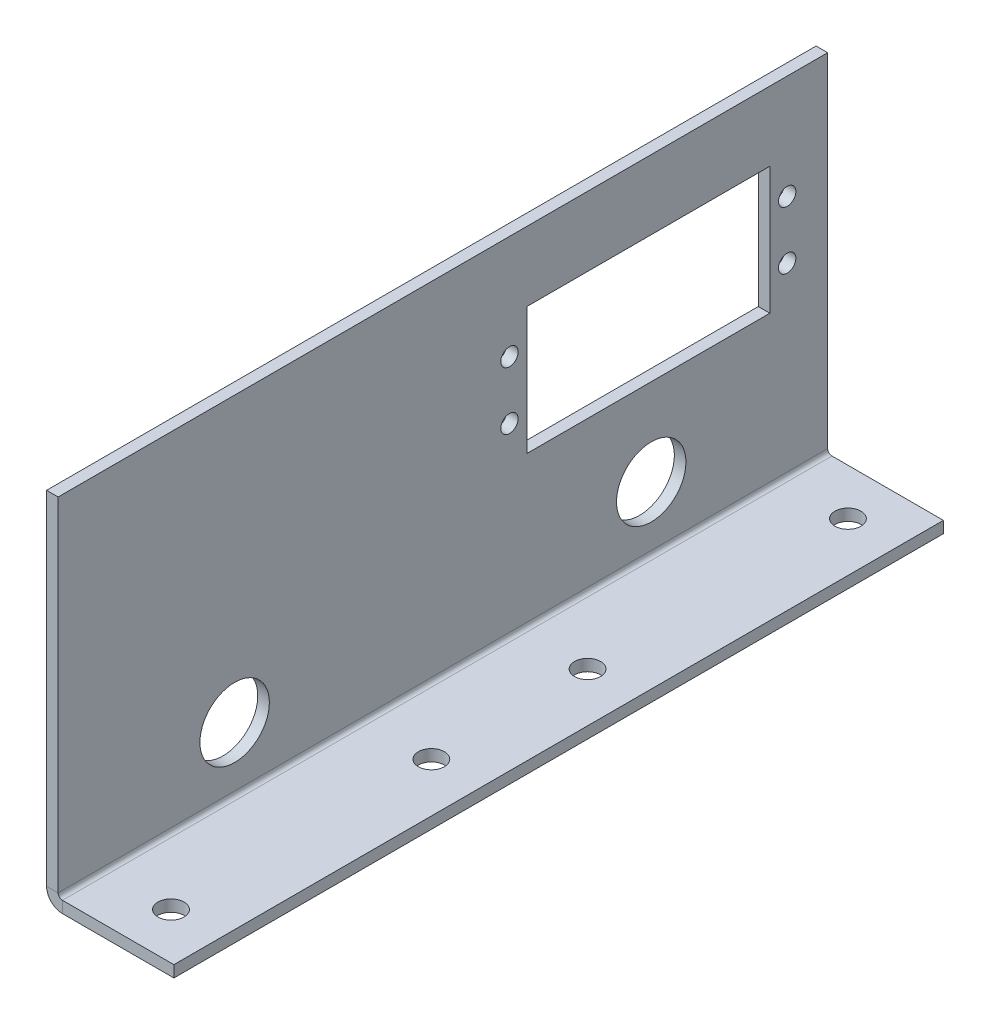
ISO-10303-21;
HEADER;
FILE_DESCRIPTION(('STEP AP214'),'2;1');
FILE_NAME('part.step','',(''),(''),'','','');
FILE_SCHEMA(('AUTOMOTIVE_DESIGN { 1 0 10303 214 1 1 1 1 }'));
ENDSEC;
DATA;
#1=APPLICATION_CONTEXT('core data for automotive mechanical design processes');
#2=APPLICATION_PROTOCOL_DEFINITION('international standard','automotive_design',2000,#1);
#3=PRODUCT_CONTEXT('',#1,'mechanical');
#4=PRODUCT('Part','Part','',(#3));
#5=PRODUCT_RELATED_PRODUCT_CATEGORY('part','',(#4));
#6=PRODUCT_DEFINITION_FORMATION('','',#4);
#7=PRODUCT_DEFINITION_CONTEXT('part definition',#1,'design');
#8=PRODUCT_DEFINITION('design','',#6,#7);
#9=PRODUCT_DEFINITION_SHAPE('','',#8);
#10=(LENGTH_UNIT() NAMED_UNIT(*) SI_UNIT(.MILLI.,.METRE.));
#11=(NAMED_UNIT(*) PLANE_ANGLE_UNIT() SI_UNIT($,.RADIAN.));
#12=(NAMED_UNIT(*) SI_UNIT($,.STERADIAN.) SOLID_ANGLE_UNIT());
#13=UNCERTAINTY_MEASURE_WITH_UNIT(LENGTH_MEASURE(1.E-05),#10,'distance_accuracy_value','');
#14=(GEOMETRIC_REPRESENTATION_CONTEXT(3) GLOBAL_UNCERTAINTY_ASSIGNED_CONTEXT((#13)) GLOBAL_UNIT_ASSIGNED_CONTEXT((#10,
#11,#12)) REPRESENTATION_CONTEXT('',''));
#15=CARTESIAN_POINT('',(0.,0.,0.));
#16=DIRECTION('',(0.,0.,1.));
#17=DIRECTION('',(1.,0.,0.));
#18=AXIS2_PLACEMENT_3D('',#15,#16,#17);
#19=CARTESIAN_POINT('',(-2.,0.,133.));
#20=DIRECTION('',(1.,0.,0.));
#21=DIRECTION('',(0.,0.,-1.));
#22=AXIS2_PLACEMENT_3D('',#19,#20,#21);
#23=PLANE('',#22);
#24=DIRECTION('',(0.,1.,0.));
#25=VECTOR('',#24,1.);
#26=CARTESIAN_POINT('',(-2.,0.,0.));
#27=LINE('',#26,#25);
#28=CARTESIAN_POINT('',(-2.,60.,0.));
#29=VERTEX_POINT('',#28);
#30=CARTESIAN_POINT('',(-2.,0.7366,0.));
#31=VERTEX_POINT('',#30);
#32=EDGE_CURVE('E216',#29,#31,#27,.F.);
#33=ORIENTED_EDGE('',*,*,#32,.T.);
#34=DIRECTION('',(0.,0.,-1.));
#35=VECTOR('',#34,1.);
#36=CARTESIAN_POINT('',(-2.,0.7366,133.));
#37=LINE('',#36,#35);
#38=CARTESIAN_POINT('',(-2.,0.7366,133.));
#39=VERTEX_POINT('',#38);
#40=EDGE_CURVE('E223',#39,#31,#37,.T.);
#41=ORIENTED_EDGE('',*,*,#40,.F.);
#42=DIRECTION('',(0.,1.,0.));
#43=VECTOR('',#42,1.);
#44=CARTESIAN_POINT('',(-2.,0.,133.));
#45=LINE('',#44,#43);
#46=CARTESIAN_POINT('',(-2.,60.,133.));
#47=VERTEX_POINT('',#46);
#48=EDGE_CURVE('E192',#47,#39,#45,.F.);
#49=ORIENTED_EDGE('',*,*,#48,.F.);
#50=DIRECTION('',(0.,0.,-1.));
#51=VECTOR('',#50,1.);
#52=CARTESIAN_POINT('',(-2.,60.,133.));
#53=LINE('',#52,#51);
#54=EDGE_CURVE('E226',#47,#29,#53,.T.);
#55=ORIENTED_EDGE('',*,*,#54,.T.);
#56=EDGE_LOOP('',(#33,#41,#49,#55));
#57=FACE_BOUND('',#56,.T.);
#58=CARTESIAN_POINT('',(-2.,11.,102.5));
#59=DIRECTION('',(-1.,0.,0.));
#60=DIRECTION('',(0.,0.,1.));
#61=AXIS2_PLACEMENT_3D('',#58,#59,#60);
#62=CIRCLE('',#61,6.);
#63=CARTESIAN_POINT('',(-2.,11.,108.5));
#64=VERTEX_POINT('',#63);
#65=EDGE_CURVE('E168',#64,#64,#62,.T.);
#66=ORIENTED_EDGE('',*,*,#65,.F.);
#67=EDGE_LOOP('',(#66));
#68=FACE_BOUND('',#67,.T.);
#69=CARTESIAN_POINT('',(-2.,11.,30.4999999999999));
#70=DIRECTION('',(-1.,0.,0.));
#71=DIRECTION('',(0.,0.,-1.));
#72=AXIS2_PLACEMENT_3D('',#69,#70,#71);
#73=CIRCLE('',#72,6.);
#74=CARTESIAN_POINT('',(-2.,11.,24.4999999999999));
#75=VERTEX_POINT('',#74);
#76=EDGE_CURVE('E162',#75,#75,#73,.T.);
#77=ORIENTED_EDGE('',*,*,#76,.F.);
#78=EDGE_LOOP('',(#77));
#79=FACE_BOUND('',#78,.T.);
#80=DIRECTION('',(0.,0.,1.));
#81=VECTOR('',#80,1.);
#82=CARTESIAN_POINT('',(-2.,26.,10.));
#83=LINE('',#82,#81);
#84=CARTESIAN_POINT('',(-2.,26.,10.));
#85=VERTEX_POINT('',#84);
#86=CARTESIAN_POINT('',(-2.,26.,52.));
#87=VERTEX_POINT('',#86);
#88=EDGE_CURVE('E146',#85,#87,#83,.T.);
#89=ORIENTED_EDGE('',*,*,#88,.F.);
#90=DIRECTION('',(0.,-1.,0.));
#91=VECTOR('',#90,1.);
#92=CARTESIAN_POINT('',(-2.,26.,10.));
#93=LINE('',#92,#91);
#94=CARTESIAN_POINT('',(-2.,48.,10.));
#95=VERTEX_POINT('',#94);
#96=EDGE_CURVE('E62',#95,#85,#93,.T.);
#97=ORIENTED_EDGE('',*,*,#96,.F.);
#98=DIRECTION('',(0.,0.,-1.));
#99=VECTOR('',#98,1.);
#100=CARTESIAN_POINT('',(-2.,48.,10.));
#101=LINE('',#100,#99);
#102=CARTESIAN_POINT('',(-2.,48.,52.));
#103=VERTEX_POINT('',#102);
#104=EDGE_CURVE('E139',#103,#95,#101,.T.);
#105=ORIENTED_EDGE('',*,*,#104,.F.);
#106=DIRECTION('',(0.,1.,0.));
#107=VECTOR('',#106,1.);
#108=CARTESIAN_POINT('',(-2.,26.,52.));
#109=LINE('',#108,#107);
#110=EDGE_CURVE('E153',#87,#103,#109,.T.);
#111=ORIENTED_EDGE('',*,*,#110,.F.);
#112=EDGE_LOOP('',(#89,#97,#105,#111));
#113=FACE_BOUND('',#112,.T.);
#114=CARTESIAN_POINT('',(-2.,32.,7.));
#115=DIRECTION('',(-1.,0.,0.));
#116=DIRECTION('',(0.,0.,1.));
#117=AXIS2_PLACEMENT_3D('',#114,#115,#116);
#118=CIRCLE('',#117,1.5);
#119=CARTESIAN_POINT('',(-2.,32.,8.5));
#120=VERTEX_POINT('',#119);
#121=EDGE_CURVE('E264',#120,#120,#118,.T.);
#122=ORIENTED_EDGE('',*,*,#121,.F.);
#123=EDGE_LOOP('',(#122));
#124=FACE_BOUND('',#123,.T.);
#125=CARTESIAN_POINT('',(-2.,42.,7.));
#126=DIRECTION('',(-1.,0.,0.));
#127=DIRECTION('',(0.,0.,1.));
#128=AXIS2_PLACEMENT_3D('',#125,#126,#127);
#129=CIRCLE('',#128,1.5);
#130=CARTESIAN_POINT('',(-2.,42.,8.5));
#131=VERTEX_POINT('',#130);
#132=EDGE_CURVE('E246',#131,#131,#129,.T.);
#133=ORIENTED_EDGE('',*,*,#132,.F.);
#134=EDGE_LOOP('',(#133));
#135=FACE_BOUND('',#134,.T.);
#136=CARTESIAN_POINT('',(-2.,32.,55.));
#137=DIRECTION('',(-1.,0.,0.));
#138=DIRECTION('',(0.,0.,1.));
#139=AXIS2_PLACEMENT_3D('',#136,#137,#138);
#140=CIRCLE('',#139,1.5);
#141=CARTESIAN_POINT('',(-2.,32.,56.5));
#142=VERTEX_POINT('',#141);
#143=EDGE_CURVE('E247',#142,#142,#140,.T.);
#144=ORIENTED_EDGE('',*,*,#143,.F.);
#145=EDGE_LOOP('',(#144));
#146=FACE_BOUND('',#145,.T.);
#147=CARTESIAN_POINT('',(-2.,42.,55.));
#148=DIRECTION('',(-1.,0.,0.));
#149=DIRECTION('',(0.,0.,1.));
#150=AXIS2_PLACEMENT_3D('',#147,#148,#149);
#151=CIRCLE('',#150,1.5);
#152=CARTESIAN_POINT('',(-2.,42.,56.5));
#153=VERTEX_POINT('',#152);
#154=EDGE_CURVE('E258',#153,#153,#151,.T.);
#155=ORIENTED_EDGE('',*,*,#154,.F.);
#156=EDGE_LOOP('',(#155));
#157=FACE_BOUND('',#156,.T.);
#158=ADVANCED_FACE('F37',(#57,#68,#79,#113,#124,#135,#146,#157),#23,.F.);
#159=CARTESIAN_POINT('',(0.7366,0.,133.));
#160=DIRECTION('',(0.,0.,1.));
#161=DIRECTION('',(1.,0.,0.));
#162=AXIS2_PLACEMENT_3D('',#159,#160,#161);
#163=PLANE('',#162);
#164=DIRECTION('',(0.,-1.,0.));
#165=VECTOR('',#164,1.);
#166=CARTESIAN_POINT('',(0.7366,0.,133.));
#167=LINE('',#166,#165);
#168=CARTESIAN_POINT('',(0.7366,0.,133.));
#169=VERTEX_POINT('',#168);
#170=CARTESIAN_POINT('',(0.7366,-2.,133.));
#171=VERTEX_POINT('',#170);
#172=EDGE_CURVE('E11',#169,#171,#167,.T.);
#173=ORIENTED_EDGE('',*,*,#172,.F.);
#174=CARTESIAN_POINT('',(0.7366,0.7366,133.));
#175=DIRECTION('',(0.,0.,-1.));
#176=DIRECTION('',(-1.,0.,0.));
#177=AXIS2_PLACEMENT_3D('',#174,#175,#176);
#178=CIRCLE('',#177,0.7366);
#179=CARTESIAN_POINT('',(0.,0.7366,133.));
#180=VERTEX_POINT('',#179);
#181=EDGE_CURVE('E183',#180,#169,#178,.F.);
#182=ORIENTED_EDGE('',*,*,#181,.F.);
#183=DIRECTION('',(1.,0.,0.));
#184=VECTOR('',#183,1.);
#185=CARTESIAN_POINT('',(-2.,0.7366,133.));
#186=LINE('',#185,#184);
#187=EDGE_CURVE('E46',#39,#180,#186,.T.);
#188=ORIENTED_EDGE('',*,*,#187,.F.);
#189=CARTESIAN_POINT('',(0.7366,0.7366,133.));
#190=DIRECTION('',(0.,0.,1.));
#191=DIRECTION('',(1.,0.,0.));
#192=AXIS2_PLACEMENT_3D('',#189,#190,#191);
#193=CIRCLE('',#192,2.7366);
#194=EDGE_CURVE('E195',#39,#171,#193,.T.);
#195=ORIENTED_EDGE('',*,*,#194,.T.);
#196=EDGE_LOOP('',(#173,#182,#188,#195));
#197=FACE_BOUND('',#196,.T.);
#198=ADVANCED_FACE('F39',(#197),#163,.T.);
#199=CARTESIAN_POINT('',(-2.,0.7366,133.));
#200=DIRECTION('',(0.,0.,1.));
#201=DIRECTION('',(1.,0.,0.));
#202=AXIS2_PLACEMENT_3D('',#199,#200,#201);
#203=PLANE('',#202);
#204=DIRECTION('',(1.,0.,0.));
#205=VECTOR('',#204,1.);
#206=CARTESIAN_POINT('',(0.,0.,133.));
#207=LINE('',#206,#205);
#208=CARTESIAN_POINT('',(20.,0.,133.));
#209=VERTEX_POINT('',#208);
#210=EDGE_CURVE('E180',#169,#209,#207,.T.);
#211=ORIENTED_EDGE('',*,*,#210,.F.);
#212=ORIENTED_EDGE('',*,*,#172,.T.);
#213=DIRECTION('',(1.,0.,0.));
#214=VECTOR('',#213,1.);
#215=CARTESIAN_POINT('',(0.,-2.,133.));
#216=LINE('',#215,#214);
#217=CARTESIAN_POINT('',(20.,-2.,133.));
#218=VERTEX_POINT('',#217);
#219=EDGE_CURVE('E174',#171,#218,#216,.T.);
#220=ORIENTED_EDGE('',*,*,#219,.T.);
#221=DIRECTION('',(0.,-1.,0.));
#222=VECTOR('',#221,1.);
#223=CARTESIAN_POINT('',(20.,0.,133.));
#224=LINE('',#223,#222);
#225=EDGE_CURVE('E176',#209,#218,#224,.T.);
#226=ORIENTED_EDGE('',*,*,#225,.F.);
#227=EDGE_LOOP('',(#211,#212,#220,#226));
#228=FACE_BOUND('',#227,.T.);
#229=ADVANCED_FACE('F372',(#228),#203,.T.);
#230=CARTESIAN_POINT('',(0.,0.7366,0.));
#231=DIRECTION('',(0.,0.,-1.));
#232=DIRECTION('',(-1.,0.,0.));
#233=AXIS2_PLACEMENT_3D('',#230,#231,#232);
#234=PLANE('',#233);
#235=DIRECTION('',(-1.,0.,0.));
#236=VECTOR('',#235,1.);
#237=CARTESIAN_POINT('',(0.,0.7366,0.));
#238=LINE('',#237,#236);
#239=CARTESIAN_POINT('',(0.,0.7366,0.));
#240=VERTEX_POINT('',#239);
#241=EDGE_CURVE('E242',#240,#31,#238,.T.);
#242=ORIENTED_EDGE('',*,*,#241,.F.);
#243=CARTESIAN_POINT('',(0.7366,0.7366,0.));
#244=DIRECTION('',(0.,0.,-1.));
#245=DIRECTION('',(-1.,0.,0.));
#246=AXIS2_PLACEMENT_3D('',#243,#244,#245);
#247=CIRCLE('',#246,0.7366);
#248=CARTESIAN_POINT('',(0.7366,0.,0.));
#249=VERTEX_POINT('',#248);
#250=EDGE_CURVE('E207',#240,#249,#247,.F.);
#251=ORIENTED_EDGE('',*,*,#250,.T.);
#252=DIRECTION('',(0.,1.,0.));
#253=VECTOR('',#252,1.);
#254=CARTESIAN_POINT('',(0.7366,-2.,0.));
#255=LINE('',#254,#253);
#256=CARTESIAN_POINT('',(0.7366,-2.,0.));
#257=VERTEX_POINT('',#256);
#258=EDGE_CURVE('E240',#257,#249,#255,.T.);
#259=ORIENTED_EDGE('',*,*,#258,.F.);
#260=CARTESIAN_POINT('',(0.7366,0.7366,0.));
#261=DIRECTION('',(0.,0.,1.));
#262=DIRECTION('',(1.,0.,0.));
#263=AXIS2_PLACEMENT_3D('',#260,#261,#262);
#264=CIRCLE('',#263,2.7366);
#265=EDGE_CURVE('E177',#31,#257,#264,.T.);
#266=ORIENTED_EDGE('',*,*,#265,.F.);
#267=EDGE_LOOP('',(#242,#251,#259,#266));
#268=FACE_BOUND('',#267,.T.);
#269=ADVANCED_FACE('F345',(#268),#234,.T.);
#270=CARTESIAN_POINT('',(0.7366,-2.,0.));
#271=DIRECTION('',(0.,0.,-1.));
#272=DIRECTION('',(-1.,0.,0.));
#273=AXIS2_PLACEMENT_3D('',#270,#271,#272);
#274=PLANE('',#273);
#275=DIRECTION('',(0.,-1.,0.));
#276=VECTOR('',#275,1.);
#277=CARTESIAN_POINT('',(0.,0.,0.));
#278=LINE('',#277,#276);
#279=CARTESIAN_POINT('',(0.,60.,0.));
#280=VERTEX_POINT('',#279);
#281=EDGE_CURVE('E210',#280,#240,#278,.T.);
#282=ORIENTED_EDGE('',*,*,#281,.T.);
#283=ORIENTED_EDGE('',*,*,#241,.T.);
#284=ORIENTED_EDGE('',*,*,#32,.F.);
#285=DIRECTION('',(1.,0.,0.));
#286=VECTOR('',#285,1.);
#287=CARTESIAN_POINT('',(-2.,60.,0.));
#288=LINE('',#287,#286);
#289=EDGE_CURVE('E213',#29,#280,#288,.T.);
#290=ORIENTED_EDGE('',*,*,#289,.T.);
#291=EDGE_LOOP('',(#282,#283,#284,#290));
#292=FACE_BOUND('',#291,.T.);
#293=ADVANCED_FACE('F352',(#292),#274,.T.);
#294=CARTESIAN_POINT('',(0.,-2.,133.));
#295=DIRECTION('',(0.,1.,0.));
#296=DIRECTION('',(0.,0.,1.));
#297=AXIS2_PLACEMENT_3D('',#294,#295,#296);
#298=PLANE('',#297);
#299=CARTESIAN_POINT('',(11.5,-2.,125.));
#300=DIRECTION('',(0.,1.,0.));
#301=DIRECTION('',(0.,0.,1.));
#302=AXIS2_PLACEMENT_3D('',#299,#300,#301);
#303=CIRCLE('',#302,2.25);
#304=CARTESIAN_POINT('',(11.5,-2.,127.25));
#305=VERTEX_POINT('',#304);
#306=EDGE_CURVE('E307',#305,#305,#303,.T.);
#307=ORIENTED_EDGE('',*,*,#306,.T.);
#308=EDGE_LOOP('',(#307));
#309=FACE_BOUND('',#308,.T.);
#310=CARTESIAN_POINT('',(11.5,-2.,53.));
#311=DIRECTION('',(0.,1.,0.));
#312=DIRECTION('',(0.,0.,1.));
#313=AXIS2_PLACEMENT_3D('',#310,#311,#312);
#314=CIRCLE('',#313,2.25);
#315=CARTESIAN_POINT('',(11.5,-2.,55.25));
#316=VERTEX_POINT('',#315);
#317=EDGE_CURVE('E301',#316,#316,#314,.T.);
#318=ORIENTED_EDGE('',*,*,#317,.T.);
#319=EDGE_LOOP('',(#318));
#320=FACE_BOUND('',#319,.T.);
#321=CARTESIAN_POINT('',(11.5,-2.,8.));
#322=DIRECTION('',(0.,1.,0.));
#323=DIRECTION('',(0.,0.,1.));
#324=AXIS2_PLACEMENT_3D('',#321,#322,#323);
#325=CIRCLE('',#324,2.25);
#326=CARTESIAN_POINT('',(11.5,-2.,10.25));
#327=VERTEX_POINT('',#326);
#328=EDGE_CURVE('E296',#327,#327,#325,.T.);
#329=ORIENTED_EDGE('',*,*,#328,.T.);
#330=EDGE_LOOP('',(#329));
#331=FACE_BOUND('',#330,.T.);
#332=CARTESIAN_POINT('',(11.5,-2.,80.));
#333=DIRECTION('',(0.,1.,0.));
#334=DIRECTION('',(0.,0.,1.));
#335=AXIS2_PLACEMENT_3D('',#332,#333,#334);
#336=CIRCLE('',#335,2.25);
#337=CARTESIAN_POINT('',(11.5,-2.,82.25));
#338=VERTEX_POINT('',#337);
#339=EDGE_CURVE('E289',#338,#338,#336,.T.);
#340=ORIENTED_EDGE('',*,*,#339,.T.);
#341=EDGE_LOOP('',(#340));
#342=FACE_BOUND('',#341,.T.);
#343=DIRECTION('',(1.,0.,0.));
#344=VECTOR('',#343,1.);
#345=CARTESIAN_POINT('',(0.,-2.,0.));
#346=LINE('',#345,#344);
#347=CARTESIAN_POINT('',(20.,-2.,0.));
#348=VERTEX_POINT('',#347);
#349=EDGE_CURVE('E171',#257,#348,#346,.T.);
#350=ORIENTED_EDGE('',*,*,#349,.T.);
#351=DIRECTION('',(0.,0.,-1.));
#352=VECTOR('',#351,1.);
#353=CARTESIAN_POINT('',(20.,-2.,133.));
#354=LINE('',#353,#352);
#355=EDGE_CURVE('E238',#218,#348,#354,.T.);
#356=ORIENTED_EDGE('',*,*,#355,.F.);
#357=ORIENTED_EDGE('',*,*,#219,.F.);
#358=DIRECTION('',(0.,0.,-1.));
#359=VECTOR('',#358,1.);
#360=CARTESIAN_POINT('',(0.7366,-2.,133.));
#361=LINE('',#360,#359);
#362=EDGE_CURVE('E198',#171,#257,#361,.T.);
#363=ORIENTED_EDGE('',*,*,#362,.T.);
#364=EDGE_LOOP('',(#350,#356,#357,#363));
#365=FACE_BOUND('',#364,.T.);
#366=ADVANCED_FACE('F316',(#309,#320,#331,#342,#365),#298,.F.);
#367=CARTESIAN_POINT('',(20.,0.,133.));
#368=DIRECTION('',(1.,0.,0.));
#369=DIRECTION('',(0.,0.,-1.));
#370=AXIS2_PLACEMENT_3D('',#367,#368,#369);
#371=PLANE('',#370);
#372=DIRECTION('',(0.,-1.,0.));
#373=VECTOR('',#372,1.);
#374=CARTESIAN_POINT('',(20.,0.,0.));
#375=LINE('',#374,#373);
#376=CARTESIAN_POINT('',(20.,0.,0.));
#377=VERTEX_POINT('',#376);
#378=EDGE_CURVE('E201',#377,#348,#375,.T.);
#379=ORIENTED_EDGE('',*,*,#378,.F.);
#380=DIRECTION('',(0.,0.,-1.));
#381=VECTOR('',#380,1.);
#382=CARTESIAN_POINT('',(20.,0.,133.));
#383=LINE('',#382,#381);
#384=EDGE_CURVE('E236',#209,#377,#383,.T.);
#385=ORIENTED_EDGE('',*,*,#384,.F.);
#386=ORIENTED_EDGE('',*,*,#225,.T.);
#387=ORIENTED_EDGE('',*,*,#355,.T.);
#388=EDGE_LOOP('',(#379,#385,#386,#387));
#389=FACE_BOUND('',#388,.T.);
#390=ADVANCED_FACE('F330',(#389),#371,.T.);
#391=CARTESIAN_POINT('',(0.,0.,133.));
#392=DIRECTION('',(0.,1.,0.));
#393=DIRECTION('',(0.,0.,1.));
#394=AXIS2_PLACEMENT_3D('',#391,#392,#393);
#395=PLANE('',#394);
#396=CARTESIAN_POINT('',(11.5,0.,125.));
#397=DIRECTION('',(0.,1.,0.));
#398=DIRECTION('',(0.,0.,1.));
#399=AXIS2_PLACEMENT_3D('',#396,#397,#398);
#400=CIRCLE('',#399,2.25);
#401=CARTESIAN_POINT('',(11.5,0.,127.25));
#402=VERTEX_POINT('',#401);
#403=EDGE_CURVE('E310',#402,#402,#400,.T.);
#404=ORIENTED_EDGE('',*,*,#403,.F.);
#405=EDGE_LOOP('',(#404));
#406=FACE_BOUND('',#405,.T.);
#407=CARTESIAN_POINT('',(11.5,0.,53.));
#408=DIRECTION('',(0.,1.,0.));
#409=DIRECTION('',(0.,0.,1.));
#410=AXIS2_PLACEMENT_3D('',#407,#408,#409);
#411=CIRCLE('',#410,2.25);
#412=CARTESIAN_POINT('',(11.5,0.,55.25));
#413=VERTEX_POINT('',#412);
#414=EDGE_CURVE('E304',#413,#413,#411,.T.);
#415=ORIENTED_EDGE('',*,*,#414,.F.);
#416=EDGE_LOOP('',(#415));
#417=FACE_BOUND('',#416,.T.);
#418=CARTESIAN_POINT('',(11.5,0.,8.));
#419=DIRECTION('',(0.,1.,0.));
#420=DIRECTION('',(0.,0.,1.));
#421=AXIS2_PLACEMENT_3D('',#418,#419,#420);
#422=CIRCLE('',#421,2.25);
#423=CARTESIAN_POINT('',(11.5,0.,10.25));
#424=VERTEX_POINT('',#423);
#425=EDGE_CURVE('E298',#424,#424,#422,.T.);
#426=ORIENTED_EDGE('',*,*,#425,.F.);
#427=EDGE_LOOP('',(#426));
#428=FACE_BOUND('',#427,.T.);
#429=CARTESIAN_POINT('',(11.5,0.,80.));
#430=DIRECTION('',(0.,1.,0.));
#431=DIRECTION('',(0.,0.,1.));
#432=AXIS2_PLACEMENT_3D('',#429,#430,#431);
#433=CIRCLE('',#432,2.25);
#434=CARTESIAN_POINT('',(11.5,0.,82.25));
#435=VERTEX_POINT('',#434);
#436=EDGE_CURVE('E291',#435,#435,#433,.T.);
#437=ORIENTED_EDGE('',*,*,#436,.F.);
#438=EDGE_LOOP('',(#437));
#439=FACE_BOUND('',#438,.T.);
#440=DIRECTION('',(1.,0.,0.));
#441=VECTOR('',#440,1.);
#442=CARTESIAN_POINT('',(0.,0.,0.));
#443=LINE('',#442,#441);
#444=EDGE_CURVE('E204',#249,#377,#443,.T.);
#445=ORIENTED_EDGE('',*,*,#444,.F.);
#446=DIRECTION('',(0.,0.,-1.));
#447=VECTOR('',#446,1.);
#448=CARTESIAN_POINT('',(0.7366,0.,133.));
#449=LINE('',#448,#447);
#450=EDGE_CURVE('E233',#169,#249,#449,.T.);
#451=ORIENTED_EDGE('',*,*,#450,.F.);
#452=ORIENTED_EDGE('',*,*,#210,.T.);
#453=ORIENTED_EDGE('',*,*,#384,.T.);
#454=EDGE_LOOP('',(#445,#451,#452,#453));
#455=FACE_BOUND('',#454,.T.);
#456=ADVANCED_FACE('F326',(#406,#417,#428,#439,#455),#395,.T.);
#457=CARTESIAN_POINT('',(0.7366,0.7366,133.));
#458=DIRECTION('',(0.,0.,-1.));
#459=DIRECTION('',(-1.,0.,0.));
#460=AXIS2_PLACEMENT_3D('',#457,#458,#459);
#461=CYLINDRICAL_SURFACE('',#460,0.7366);
#462=ORIENTED_EDGE('',*,*,#250,.F.);
#463=DIRECTION('',(0.,0.,-1.));
#464=VECTOR('',#463,1.);
#465=CARTESIAN_POINT('',(0.,0.7366,133.));
#466=LINE('',#465,#464);
#467=EDGE_CURVE('E230',#180,#240,#466,.T.);
#468=ORIENTED_EDGE('',*,*,#467,.F.);
#469=ORIENTED_EDGE('',*,*,#181,.T.);
#470=ORIENTED_EDGE('',*,*,#450,.T.);
#471=EDGE_LOOP('',(#462,#468,#469,#470));
#472=FACE_BOUND('',#471,.T.);
#473=ADVANCED_FACE('F329',(#472),#461,.F.);
#474=CARTESIAN_POINT('',(0.,0.,133.));
#475=DIRECTION('',(1.,0.,0.));
#476=DIRECTION('',(0.,0.,-1.));
#477=AXIS2_PLACEMENT_3D('',#474,#475,#476);
#478=PLANE('',#477);
#479=CARTESIAN_POINT('',(0.,42.,55.));
#480=DIRECTION('',(1.,0.,0.));
#481=DIRECTION('',(0.,0.,-1.));
#482=AXIS2_PLACEMENT_3D('',#479,#480,#481);
#483=CIRCLE('',#482,1.5);
#484=CARTESIAN_POINT('',(0.,42.,53.5));
#485=VERTEX_POINT('',#484);
#486=EDGE_CURVE('E41',#485,#485,#483,.T.);
#487=ORIENTED_EDGE('',*,*,#486,.F.);
#488=EDGE_LOOP('',(#487));
#489=FACE_BOUND('',#488,.T.);
#490=CARTESIAN_POINT('',(0.,32.,55.));
#491=DIRECTION('',(1.,0.,0.));
#492=DIRECTION('',(0.,0.,-1.));
#493=AXIS2_PLACEMENT_3D('',#490,#491,#492);
#494=CIRCLE('',#493,1.5);
#495=CARTESIAN_POINT('',(0.,32.,53.5));
#496=VERTEX_POINT('',#495);
#497=EDGE_CURVE('E244',#496,#496,#494,.T.);
#498=ORIENTED_EDGE('',*,*,#497,.F.);
#499=EDGE_LOOP('',(#498));
#500=FACE_BOUND('',#499,.T.);
#501=CARTESIAN_POINT('',(0.,42.,7.));
#502=DIRECTION('',(1.,0.,0.));
#503=DIRECTION('',(0.,0.,-1.));
#504=AXIS2_PLACEMENT_3D('',#501,#502,#503);
#505=CIRCLE('',#504,1.5);
#506=CARTESIAN_POINT('',(0.,42.,5.49999999999999));
#507=VERTEX_POINT('',#506);
#508=EDGE_CURVE('E251',#507,#507,#505,.T.);
#509=ORIENTED_EDGE('',*,*,#508,.F.);
#510=EDGE_LOOP('',(#509));
#511=FACE_BOUND('',#510,.T.);
#512=CARTESIAN_POINT('',(0.,32.,7.));
#513=DIRECTION('',(1.,0.,0.));
#514=DIRECTION('',(0.,0.,-1.));
#515=AXIS2_PLACEMENT_3D('',#512,#513,#514);
#516=CIRCLE('',#515,1.5);
#517=CARTESIAN_POINT('',(0.,32.,5.49999999999999));
#518=VERTEX_POINT('',#517);
#519=EDGE_CURVE('E267',#518,#518,#516,.T.);
#520=ORIENTED_EDGE('',*,*,#519,.F.);
#521=EDGE_LOOP('',(#520));
#522=FACE_BOUND('',#521,.T.);
#523=DIRECTION('',(0.,-1.,0.));
#524=VECTOR('',#523,1.);
#525=CARTESIAN_POINT('',(0.,26.,10.));
#526=LINE('',#525,#524);
#527=CARTESIAN_POINT('',(0.,48.,10.));
#528=VERTEX_POINT('',#527);
#529=CARTESIAN_POINT('',(0.,26.,10.));
#530=VERTEX_POINT('',#529);
#531=EDGE_CURVE('E137',#528,#530,#526,.T.);
#532=ORIENTED_EDGE('',*,*,#531,.T.);
#533=DIRECTION('',(0.,0.,1.));
#534=VECTOR('',#533,1.);
#535=CARTESIAN_POINT('',(0.,26.,10.));
#536=LINE('',#535,#534);
#537=CARTESIAN_POINT('',(0.,26.,52.));
#538=VERTEX_POINT('',#537);
#539=EDGE_CURVE('E126',#530,#538,#536,.T.);
#540=ORIENTED_EDGE('',*,*,#539,.T.);
#541=DIRECTION('',(0.,1.,0.));
#542=VECTOR('',#541,1.);
#543=CARTESIAN_POINT('',(0.,26.,52.));
#544=LINE('',#543,#542);
#545=CARTESIAN_POINT('',(0.,48.,52.));
#546=VERTEX_POINT('',#545);
#547=EDGE_CURVE('E148',#538,#546,#544,.T.);
#548=ORIENTED_EDGE('',*,*,#547,.T.);
#549=DIRECTION('',(0.,0.,-1.));
#550=VECTOR('',#549,1.);
#551=CARTESIAN_POINT('',(0.,48.,10.));
#552=LINE('',#551,#550);
#553=EDGE_CURVE('E144',#546,#528,#552,.T.);
#554=ORIENTED_EDGE('',*,*,#553,.T.);
#555=EDGE_LOOP('',(#532,#540,#548,#554));
#556=FACE_BOUND('',#555,.T.);
#557=CARTESIAN_POINT('',(0.,11.,30.4999999999999));
#558=DIRECTION('',(1.,0.,0.));
#559=DIRECTION('',(0.,0.,-1.));
#560=AXIS2_PLACEMENT_3D('',#557,#558,#559);
#561=CIRCLE('',#560,6.);
#562=CARTESIAN_POINT('',(0.,11.,24.4999999999999));
#563=VERTEX_POINT('',#562);
#564=EDGE_CURVE('E133',#563,#563,#561,.F.);
#565=ORIENTED_EDGE('',*,*,#564,.T.);
#566=EDGE_LOOP('',(#565));
#567=FACE_BOUND('',#566,.T.);
#568=CARTESIAN_POINT('',(0.,11.,102.5));
#569=DIRECTION('',(1.,0.,0.));
#570=DIRECTION('',(0.,0.,-1.));
#571=AXIS2_PLACEMENT_3D('',#568,#569,#570);
#572=CIRCLE('',#571,6.);
#573=CARTESIAN_POINT('',(0.,11.,96.5000000000001));
#574=VERTEX_POINT('',#573);
#575=EDGE_CURVE('E165',#574,#574,#572,.F.);
#576=ORIENTED_EDGE('',*,*,#575,.T.);
#577=EDGE_LOOP('',(#576));
#578=FACE_BOUND('',#577,.T.);
#579=ORIENTED_EDGE('',*,*,#281,.F.);
#580=DIRECTION('',(0.,0.,-1.));
#581=VECTOR('',#580,1.);
#582=CARTESIAN_POINT('',(0.,60.,133.));
#583=LINE('',#582,#581);
#584=CARTESIAN_POINT('',(0.,60.,133.));
#585=VERTEX_POINT('',#584);
#586=EDGE_CURVE('E228',#585,#280,#583,.T.);
#587=ORIENTED_EDGE('',*,*,#586,.F.);
#588=DIRECTION('',(0.,-1.,0.));
#589=VECTOR('',#588,1.);
#590=CARTESIAN_POINT('',(0.,0.,133.));
#591=LINE('',#590,#589);
#592=EDGE_CURVE('E186',#585,#180,#591,.T.);
#593=ORIENTED_EDGE('',*,*,#592,.T.);
#594=ORIENTED_EDGE('',*,*,#467,.T.);
#595=EDGE_LOOP('',(#579,#587,#593,#594));
#596=FACE_BOUND('',#595,.T.);
#597=ADVANCED_FACE('F142',(#489,#500,#511,#522,#556,#567,#578,#596),#478,.T.);
#598=CARTESIAN_POINT('',(-2.,60.,133.));
#599=DIRECTION('',(0.,1.,0.));
#600=DIRECTION('',(0.,0.,1.));
#601=AXIS2_PLACEMENT_3D('',#598,#599,#600);
#602=PLANE('',#601);
#603=ORIENTED_EDGE('',*,*,#289,.F.);
#604=ORIENTED_EDGE('',*,*,#54,.F.);
#605=DIRECTION('',(1.,0.,0.));
#606=VECTOR('',#605,1.);
#607=CARTESIAN_POINT('',(-2.,60.,133.));
#608=LINE('',#607,#606);
#609=EDGE_CURVE('E189',#47,#585,#608,.T.);
#610=ORIENTED_EDGE('',*,*,#609,.T.);
#611=ORIENTED_EDGE('',*,*,#586,.T.);
#612=EDGE_LOOP('',(#603,#604,#610,#611));
#613=FACE_BOUND('',#612,.T.);
#614=ADVANCED_FACE('F361',(#613),#602,.T.);
#615=CARTESIAN_POINT('',(0.7366,0.7366,133.));
#616=DIRECTION('',(0.,0.,-1.));
#617=DIRECTION('',(-1.,0.,0.));
#618=AXIS2_PLACEMENT_3D('',#615,#616,#617);
#619=CYLINDRICAL_SURFACE('',#618,2.7366);
#620=ORIENTED_EDGE('',*,*,#265,.T.);
#621=ORIENTED_EDGE('',*,*,#362,.F.);
#622=ORIENTED_EDGE('',*,*,#194,.F.);
#623=ORIENTED_EDGE('',*,*,#40,.T.);
#624=EDGE_LOOP('',(#620,#621,#622,#623));
#625=FACE_BOUND('',#624,.T.);
#626=ADVANCED_FACE('F368',(#625),#619,.T.);
#627=CARTESIAN_POINT('',(0.7366,0.7366,133.));
#628=DIRECTION('',(0.,0.,-1.));
#629=DIRECTION('',(-1.,0.,0.));
#630=AXIS2_PLACEMENT_3D('',#627,#628,#629);
#631=PLANE('',#630);
#632=ORIENTED_EDGE('',*,*,#48,.T.);
#633=ORIENTED_EDGE('',*,*,#187,.T.);
#634=ORIENTED_EDGE('',*,*,#592,.F.);
#635=ORIENTED_EDGE('',*,*,#609,.F.);
#636=EDGE_LOOP('',(#632,#633,#634,#635));
#637=FACE_BOUND('',#636,.T.);
#638=ADVANCED_FACE('F359',(#637),#631,.F.);
#639=CARTESIAN_POINT('',(0.7366,0.7366,0.));
#640=DIRECTION('',(0.,0.,-1.));
#641=DIRECTION('',(-1.,0.,0.));
#642=AXIS2_PLACEMENT_3D('',#639,#640,#641);
#643=PLANE('',#642);
#644=ORIENTED_EDGE('',*,*,#349,.F.);
#645=ORIENTED_EDGE('',*,*,#258,.T.);
#646=ORIENTED_EDGE('',*,*,#444,.T.);
#647=ORIENTED_EDGE('',*,*,#378,.T.);
#648=EDGE_LOOP('',(#644,#645,#646,#647));
#649=FACE_BOUND('',#648,.T.);
#650=ADVANCED_FACE('F377',(#649),#643,.T.);
#651=CARTESIAN_POINT('',(20.001,11.,102.5));
#652=DIRECTION('',(-1.,0.,0.));
#653=DIRECTION('',(0.,0.,1.));
#654=AXIS2_PLACEMENT_3D('',#651,#652,#653);
#655=CYLINDRICAL_SURFACE('',#654,6.);
#656=ORIENTED_EDGE('',*,*,#575,.F.);
#657=EDGE_LOOP('',(#656));
#658=FACE_BOUND('',#657,.T.);
#659=ORIENTED_EDGE('',*,*,#65,.T.);
#660=EDGE_LOOP('',(#659));
#661=FACE_BOUND('',#660,.T.);
#662=ADVANCED_FACE('F532',(#658,#661),#655,.F.);
#663=CARTESIAN_POINT('',(20.001,11.,30.4999999999999));
#664=DIRECTION('',(-1.,0.,0.));
#665=DIRECTION('',(0.,0.,1.));
#666=AXIS2_PLACEMENT_3D('',#663,#664,#665);
#667=CYLINDRICAL_SURFACE('',#666,6.);
#668=ORIENTED_EDGE('',*,*,#564,.F.);
#669=EDGE_LOOP('',(#668));
#670=FACE_BOUND('',#669,.T.);
#671=ORIENTED_EDGE('',*,*,#76,.T.);
#672=EDGE_LOOP('',(#671));
#673=FACE_BOUND('',#672,.T.);
#674=ADVANCED_FACE('F529',(#670,#673),#667,.F.);
#675=CARTESIAN_POINT('',(20.001,26.,10.));
#676=DIRECTION('',(0.,0.,-1.));
#677=DIRECTION('',(-1.,0.,0.));
#678=AXIS2_PLACEMENT_3D('',#675,#676,#677);
#679=PLANE('',#678);
#680=DIRECTION('',(-1.,0.,0.));
#681=VECTOR('',#680,1.);
#682=CARTESIAN_POINT('',(20.001,48.,10.));
#683=LINE('',#682,#681);
#684=EDGE_CURVE('E134',#528,#95,#683,.T.);
#685=ORIENTED_EDGE('',*,*,#684,.T.);
#686=ORIENTED_EDGE('',*,*,#96,.T.);
#687=DIRECTION('',(-1.,0.,0.));
#688=VECTOR('',#687,1.);
#689=CARTESIAN_POINT('',(20.001,26.,10.));
#690=LINE('',#689,#688);
#691=EDGE_CURVE('E128',#530,#85,#690,.T.);
#692=ORIENTED_EDGE('',*,*,#691,.F.);
#693=ORIENTED_EDGE('',*,*,#531,.F.);
#694=EDGE_LOOP('',(#685,#686,#692,#693));
#695=FACE_BOUND('',#694,.T.);
#696=ADVANCED_FACE('F136',(#695),#679,.F.);
#697=CARTESIAN_POINT('',(20.001,48.,10.));
#698=DIRECTION('',(0.,1.,0.));
#699=DIRECTION('',(0.,0.,1.));
#700=AXIS2_PLACEMENT_3D('',#697,#698,#699);
#701=PLANE('',#700);
#702=DIRECTION('',(-1.,0.,0.));
#703=VECTOR('',#702,1.);
#704=CARTESIAN_POINT('',(20.001,48.,52.));
#705=LINE('',#704,#703);
#706=EDGE_CURVE('E159',#546,#103,#705,.T.);
#707=ORIENTED_EDGE('',*,*,#706,.T.);
#708=ORIENTED_EDGE('',*,*,#104,.T.);
#709=ORIENTED_EDGE('',*,*,#684,.F.);
#710=ORIENTED_EDGE('',*,*,#553,.F.);
#711=EDGE_LOOP('',(#707,#708,#709,#710));
#712=FACE_BOUND('',#711,.T.);
#713=ADVANCED_FACE('F275',(#712),#701,.F.);
#714=CARTESIAN_POINT('',(20.001,26.,52.));
#715=DIRECTION('',(0.,0.,1.));
#716=DIRECTION('',(1.,0.,0.));
#717=AXIS2_PLACEMENT_3D('',#714,#715,#716);
#718=PLANE('',#717);
#719=DIRECTION('',(-1.,0.,0.));
#720=VECTOR('',#719,1.);
#721=CARTESIAN_POINT('',(20.001,26.,52.));
#722=LINE('',#721,#720);
#723=EDGE_CURVE('E54',#538,#87,#722,.T.);
#724=ORIENTED_EDGE('',*,*,#723,.T.);
#725=ORIENTED_EDGE('',*,*,#110,.T.);
#726=ORIENTED_EDGE('',*,*,#706,.F.);
#727=ORIENTED_EDGE('',*,*,#547,.F.);
#728=EDGE_LOOP('',(#724,#725,#726,#727));
#729=FACE_BOUND('',#728,.T.);
#730=ADVANCED_FACE('F271',(#729),#718,.F.);
#731=CARTESIAN_POINT('',(20.001,26.,10.));
#732=DIRECTION('',(0.,-1.,0.));
#733=DIRECTION('',(0.,0.,-1.));
#734=AXIS2_PLACEMENT_3D('',#731,#732,#733);
#735=PLANE('',#734);
#736=ORIENTED_EDGE('',*,*,#691,.T.);
#737=ORIENTED_EDGE('',*,*,#88,.T.);
#738=ORIENTED_EDGE('',*,*,#723,.F.);
#739=ORIENTED_EDGE('',*,*,#539,.F.);
#740=EDGE_LOOP('',(#736,#737,#738,#739));
#741=FACE_BOUND('',#740,.T.);
#742=ADVANCED_FACE('F127',(#741),#735,.F.);
#743=CARTESIAN_POINT('',(-2.,32.,7.));
#744=DIRECTION('',(-1.,0.,0.));
#745=DIRECTION('',(0.,0.,1.));
#746=AXIS2_PLACEMENT_3D('',#743,#744,#745);
#747=CYLINDRICAL_SURFACE('',#746,1.5);
#748=ORIENTED_EDGE('',*,*,#519,.T.);
#749=EDGE_LOOP('',(#748));
#750=FACE_BOUND('',#749,.T.);
#751=ORIENTED_EDGE('',*,*,#121,.T.);
#752=EDGE_LOOP('',(#751));
#753=FACE_BOUND('',#752,.T.);
#754=ADVANCED_FACE('F425',(#750,#753),#747,.F.);
#755=CARTESIAN_POINT('',(-2.,42.,7.));
#756=DIRECTION('',(-1.,0.,0.));
#757=DIRECTION('',(0.,0.,1.));
#758=AXIS2_PLACEMENT_3D('',#755,#756,#757);
#759=CYLINDRICAL_SURFACE('',#758,1.5);
#760=ORIENTED_EDGE('',*,*,#508,.T.);
#761=EDGE_LOOP('',(#760));
#762=FACE_BOUND('',#761,.T.);
#763=ORIENTED_EDGE('',*,*,#132,.T.);
#764=EDGE_LOOP('',(#763));
#765=FACE_BOUND('',#764,.T.);
#766=ADVANCED_FACE('F430',(#762,#765),#759,.F.);
#767=CARTESIAN_POINT('',(-2.,32.,55.));
#768=DIRECTION('',(-1.,0.,0.));
#769=DIRECTION('',(0.,0.,1.));
#770=AXIS2_PLACEMENT_3D('',#767,#768,#769);
#771=CYLINDRICAL_SURFACE('',#770,1.5);
#772=ORIENTED_EDGE('',*,*,#497,.T.);
#773=EDGE_LOOP('',(#772));
#774=FACE_BOUND('',#773,.T.);
#775=ORIENTED_EDGE('',*,*,#143,.T.);
#776=EDGE_LOOP('',(#775));
#777=FACE_BOUND('',#776,.T.);
#778=ADVANCED_FACE('F440',(#774,#777),#771,.F.);
#779=CARTESIAN_POINT('',(-2.,42.,55.));
#780=DIRECTION('',(-1.,0.,0.));
#781=DIRECTION('',(0.,0.,1.));
#782=AXIS2_PLACEMENT_3D('',#779,#780,#781);
#783=CYLINDRICAL_SURFACE('',#782,1.5);
#784=ORIENTED_EDGE('',*,*,#486,.T.);
#785=EDGE_LOOP('',(#784));
#786=FACE_BOUND('',#785,.T.);
#787=ORIENTED_EDGE('',*,*,#154,.T.);
#788=EDGE_LOOP('',(#787));
#789=FACE_BOUND('',#788,.T.);
#790=ADVANCED_FACE('F450',(#786,#789),#783,.F.);
#791=CARTESIAN_POINT('',(11.5,-2.,80.));
#792=DIRECTION('',(0.,1.,0.));
#793=DIRECTION('',(0.,0.,1.));
#794=AXIS2_PLACEMENT_3D('',#791,#792,#793);
#795=CYLINDRICAL_SURFACE('',#794,2.25);
#796=ORIENTED_EDGE('',*,*,#339,.F.);
#797=EDGE_LOOP('',(#796));
#798=FACE_BOUND('',#797,.T.);
#799=ORIENTED_EDGE('',*,*,#436,.T.);
#800=EDGE_LOOP('',(#799));
#801=FACE_BOUND('',#800,.T.);
#802=ADVANCED_FACE('F458',(#798,#801),#795,.F.);
#803=CARTESIAN_POINT('',(11.5,-2.,8.));
#804=DIRECTION('',(0.,1.,0.));
#805=DIRECTION('',(0.,0.,1.));
#806=AXIS2_PLACEMENT_3D('',#803,#804,#805);
#807=CYLINDRICAL_SURFACE('',#806,2.25);
#808=ORIENTED_EDGE('',*,*,#328,.F.);
#809=EDGE_LOOP('',(#808));
#810=FACE_BOUND('',#809,.T.);
#811=ORIENTED_EDGE('',*,*,#425,.T.);
#812=EDGE_LOOP('',(#811));
#813=FACE_BOUND('',#812,.T.);
#814=ADVANCED_FACE('F483',(#810,#813),#807,.F.);
#815=CARTESIAN_POINT('',(11.5,-2.,53.));
#816=DIRECTION('',(0.,1.,0.));
#817=DIRECTION('',(0.,0.,1.));
#818=AXIS2_PLACEMENT_3D('',#815,#816,#817);
#819=CYLINDRICAL_SURFACE('',#818,2.25);
#820=ORIENTED_EDGE('',*,*,#317,.F.);
#821=EDGE_LOOP('',(#820));
#822=FACE_BOUND('',#821,.T.);
#823=ORIENTED_EDGE('',*,*,#414,.T.);
#824=EDGE_LOOP('',(#823));
#825=FACE_BOUND('',#824,.T.);
#826=ADVANCED_FACE('F322',(#822,#825),#819,.F.);
#827=CARTESIAN_POINT('',(11.5,-2.,125.));
#828=DIRECTION('',(0.,1.,0.));
#829=DIRECTION('',(0.,0.,1.));
#830=AXIS2_PLACEMENT_3D('',#827,#828,#829);
#831=CYLINDRICAL_SURFACE('',#830,2.25);
#832=ORIENTED_EDGE('',*,*,#306,.F.);
#833=EDGE_LOOP('',(#832));
#834=FACE_BOUND('',#833,.T.);
#835=ORIENTED_EDGE('',*,*,#403,.T.);
#836=EDGE_LOOP('',(#835));
#837=FACE_BOUND('',#836,.T.);
#838=ADVANCED_FACE('F319',(#834,#837),#831,.F.);
#839=CLOSED_SHELL('',(#158,#198,#229,#269,#293,#366,#390,#456,#473,#597,#614,#626,#638,#650,
#662,#674,#696,#713,#730,#742,#754,#766,#778,#790,#802,#814,#826,#838));
#840=MANIFOLD_SOLID_BREP('B2',#839);
#841=ADVANCED_BREP_SHAPE_REPRESENTATION('',(#18,#840),#14);
#842=SHAPE_DEFINITION_REPRESENTATION(#9,#841);
ENDSEC;
END-ISO-10303-21;
